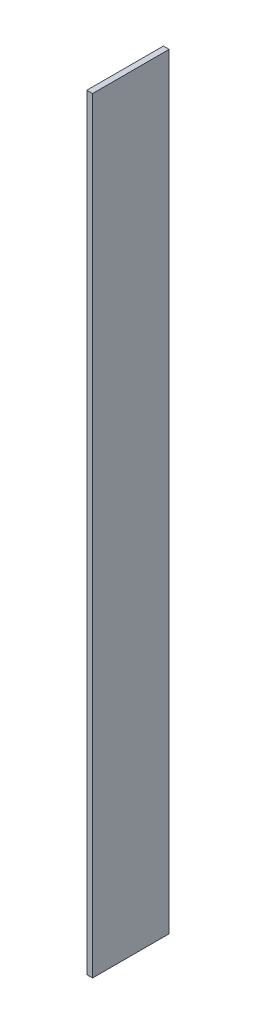
ISO-10303-21;
HEADER;
FILE_DESCRIPTION(('STEP AP214'),'2;1');
FILE_NAME('part.step','',(''),(''),'','','');
FILE_SCHEMA(('AUTOMOTIVE_DESIGN { 1 0 10303 214 1 1 1 1 }'));
ENDSEC;
DATA;
#1=APPLICATION_CONTEXT('core data for automotive mechanical design processes');
#2=APPLICATION_PROTOCOL_DEFINITION('international standard','automotive_design',2000,#1);
#3=PRODUCT_CONTEXT('',#1,'mechanical');
#4=PRODUCT('Part','Part','',(#3));
#5=PRODUCT_RELATED_PRODUCT_CATEGORY('part','',(#4));
#6=PRODUCT_DEFINITION_FORMATION('','',#4);
#7=PRODUCT_DEFINITION_CONTEXT('part definition',#1,'design');
#8=PRODUCT_DEFINITION('design','',#6,#7);
#9=PRODUCT_DEFINITION_SHAPE('','',#8);
#10=(LENGTH_UNIT() NAMED_UNIT(*) SI_UNIT(.MILLI.,.METRE.));
#11=(NAMED_UNIT(*) PLANE_ANGLE_UNIT() SI_UNIT($,.RADIAN.));
#12=(NAMED_UNIT(*) SI_UNIT($,.STERADIAN.) SOLID_ANGLE_UNIT());
#13=UNCERTAINTY_MEASURE_WITH_UNIT(LENGTH_MEASURE(1.E-05),#10,'distance_accuracy_value','');
#14=(GEOMETRIC_REPRESENTATION_CONTEXT(3) GLOBAL_UNCERTAINTY_ASSIGNED_CONTEXT((#13)) GLOBAL_UNIT_ASSIGNED_CONTEXT((#10,
#11,#12)) REPRESENTATION_CONTEXT('',''));
#15=CARTESIAN_POINT('',(0.,0.,0.));
#16=DIRECTION('',(0.,0.,1.));
#17=DIRECTION('',(1.,0.,0.));
#18=AXIS2_PLACEMENT_3D('',#15,#16,#17);
#19=CARTESIAN_POINT('',(1.5,0.,20.));
#20=DIRECTION('',(-1.,0.,0.));
#21=DIRECTION('',(0.,0.,1.));
#22=AXIS2_PLACEMENT_3D('',#19,#20,#21);
#23=PLANE('',#22);
#24=DIRECTION('',(0.,1.,0.));
#25=VECTOR('',#24,1.);
#26=CARTESIAN_POINT('',(1.5,0.,0.));
#27=LINE('',#26,#25);
#28=CARTESIAN_POINT('',(1.5,0.,0.));
#29=VERTEX_POINT('',#28);
#30=CARTESIAN_POINT('',(1.5,200.,0.));
#31=VERTEX_POINT('',#30);
#32=EDGE_CURVE('E100',#29,#31,#27,.T.);
#33=ORIENTED_EDGE('',*,*,#32,.T.);
#34=DIRECTION('',(0.,0.,-1.));
#35=VECTOR('',#34,1.);
#36=CARTESIAN_POINT('',(1.5,200.,20.));
#37=LINE('',#36,#35);
#38=CARTESIAN_POINT('',(1.5,200.,20.));
#39=VERTEX_POINT('',#38);
#40=EDGE_CURVE('E11',#39,#31,#37,.T.);
#41=ORIENTED_EDGE('',*,*,#40,.F.);
#42=DIRECTION('',(0.,1.,0.));
#43=VECTOR('',#42,1.);
#44=CARTESIAN_POINT('',(1.5,0.,20.));
#45=LINE('',#44,#43);
#46=CARTESIAN_POINT('',(1.5,0.,20.));
#47=VERTEX_POINT('',#46);
#48=EDGE_CURVE('E77',#47,#39,#45,.T.);
#49=ORIENTED_EDGE('',*,*,#48,.F.);
#50=DIRECTION('',(0.,0.,-1.));
#51=VECTOR('',#50,1.);
#52=CARTESIAN_POINT('',(1.5,0.,20.));
#53=LINE('',#52,#51);
#54=EDGE_CURVE('E53',#47,#29,#53,.T.);
#55=ORIENTED_EDGE('',*,*,#54,.T.);
#56=EDGE_LOOP('',(#33,#41,#49,#55));
#57=FACE_BOUND('',#56,.T.);
#58=ADVANCED_FACE('F37',(#57),#23,.F.);
#59=CARTESIAN_POINT('',(0.,200.,20.));
#60=DIRECTION('',(0.,1.,0.));
#61=DIRECTION('',(0.,0.,1.));
#62=AXIS2_PLACEMENT_3D('',#59,#60,#61);
#63=PLANE('',#62);
#64=DIRECTION('',(1.,0.,0.));
#65=VECTOR('',#64,1.);
#66=CARTESIAN_POINT('',(0.,200.,0.));
#67=LINE('',#66,#65);
#68=CARTESIAN_POINT('',(0.,200.,0.));
#69=VERTEX_POINT('',#68);
#70=EDGE_CURVE('E86',#69,#31,#67,.T.);
#71=ORIENTED_EDGE('',*,*,#70,.F.);
#72=DIRECTION('',(0.,0.,-1.));
#73=VECTOR('',#72,1.);
#74=CARTESIAN_POINT('',(0.,200.,20.));
#75=LINE('',#74,#73);
#76=CARTESIAN_POINT('',(0.,200.,20.));
#77=VERTEX_POINT('',#76);
#78=EDGE_CURVE('E45',#77,#69,#75,.T.);
#79=ORIENTED_EDGE('',*,*,#78,.F.);
#80=DIRECTION('',(1.,0.,0.));
#81=VECTOR('',#80,1.);
#82=CARTESIAN_POINT('',(0.,200.,20.));
#83=LINE('',#82,#81);
#84=EDGE_CURVE('E84',#77,#39,#83,.T.);
#85=ORIENTED_EDGE('',*,*,#84,.T.);
#86=ORIENTED_EDGE('',*,*,#40,.T.);
#87=EDGE_LOOP('',(#71,#79,#85,#86));
#88=FACE_BOUND('',#87,.T.);
#89=ADVANCED_FACE('F83',(#88),#63,.T.);
#90=CARTESIAN_POINT('',(0.,0.,20.));
#91=DIRECTION('',(-1.,0.,0.));
#92=DIRECTION('',(0.,0.,1.));
#93=AXIS2_PLACEMENT_3D('',#90,#91,#92);
#94=PLANE('',#93);
#95=DIRECTION('',(0.,1.,0.));
#96=VECTOR('',#95,1.);
#97=CARTESIAN_POINT('',(0.,0.,0.));
#98=LINE('',#97,#96);
#99=CARTESIAN_POINT('',(0.,0.,0.));
#100=VERTEX_POINT('',#99);
#101=EDGE_CURVE('E103',#100,#69,#98,.T.);
#102=ORIENTED_EDGE('',*,*,#101,.F.);
#103=DIRECTION('',(0.,0.,-1.));
#104=VECTOR('',#103,1.);
#105=CARTESIAN_POINT('',(0.,0.,20.));
#106=LINE('',#105,#104);
#107=CARTESIAN_POINT('',(0.,0.,20.));
#108=VERTEX_POINT('',#107);
#109=EDGE_CURVE('E66',#108,#100,#106,.T.);
#110=ORIENTED_EDGE('',*,*,#109,.F.);
#111=DIRECTION('',(0.,1.,0.));
#112=VECTOR('',#111,1.);
#113=CARTESIAN_POINT('',(0.,0.,20.));
#114=LINE('',#113,#112);
#115=EDGE_CURVE('E92',#108,#77,#114,.T.);
#116=ORIENTED_EDGE('',*,*,#115,.T.);
#117=ORIENTED_EDGE('',*,*,#78,.T.);
#118=EDGE_LOOP('',(#102,#110,#116,#117));
#119=FACE_BOUND('',#118,.T.);
#120=ADVANCED_FACE('F94',(#119),#94,.T.);
#121=CARTESIAN_POINT('',(1.5,0.,20.));
#122=DIRECTION('',(0.,-1.,0.));
#123=DIRECTION('',(0.,0.,-1.));
#124=AXIS2_PLACEMENT_3D('',#121,#122,#123);
#125=PLANE('',#124);
#126=DIRECTION('',(-1.,0.,0.));
#127=VECTOR('',#126,1.);
#128=CARTESIAN_POINT('',(1.5,0.,0.));
#129=LINE('',#128,#127);
#130=EDGE_CURVE('E105',#29,#100,#129,.T.);
#131=ORIENTED_EDGE('',*,*,#130,.F.);
#132=ORIENTED_EDGE('',*,*,#54,.F.);
#133=DIRECTION('',(-1.,0.,0.));
#134=VECTOR('',#133,1.);
#135=CARTESIAN_POINT('',(1.5,0.,20.));
#136=LINE('',#135,#134);
#137=EDGE_CURVE('E95',#47,#108,#136,.T.);
#138=ORIENTED_EDGE('',*,*,#137,.T.);
#139=ORIENTED_EDGE('',*,*,#109,.T.);
#140=EDGE_LOOP('',(#131,#132,#138,#139));
#141=FACE_BOUND('',#140,.T.);
#142=ADVANCED_FACE('F111',(#141),#125,.T.);
#143=CARTESIAN_POINT('',(0.,0.,20.));
#144=DIRECTION('',(0.,0.,-1.));
#145=DIRECTION('',(-1.,0.,0.));
#146=AXIS2_PLACEMENT_3D('',#143,#144,#145);
#147=PLANE('',#146);
#148=ORIENTED_EDGE('',*,*,#48,.T.);
#149=ORIENTED_EDGE('',*,*,#84,.F.);
#150=ORIENTED_EDGE('',*,*,#115,.F.);
#151=ORIENTED_EDGE('',*,*,#137,.F.);
#152=EDGE_LOOP('',(#148,#149,#150,#151));
#153=FACE_BOUND('',#152,.T.);
#154=ADVANCED_FACE('F91',(#153),#147,.F.);
#155=CARTESIAN_POINT('',(0.,0.,0.));
#156=DIRECTION('',(0.,0.,-1.));
#157=DIRECTION('',(-1.,0.,0.));
#158=AXIS2_PLACEMENT_3D('',#155,#156,#157);
#159=PLANE('',#158);
#160=ORIENTED_EDGE('',*,*,#32,.F.);
#161=ORIENTED_EDGE('',*,*,#130,.T.);
#162=ORIENTED_EDGE('',*,*,#101,.T.);
#163=ORIENTED_EDGE('',*,*,#70,.T.);
#164=EDGE_LOOP('',(#160,#161,#162,#163));
#165=FACE_BOUND('',#164,.T.);
#166=ADVANCED_FACE('F110',(#165),#159,.T.);
#167=CLOSED_SHELL('',(#58,#89,#120,#142,#154,#166));
#168=MANIFOLD_SOLID_BREP('B2',#167);
#169=ADVANCED_BREP_SHAPE_REPRESENTATION('',(#18,#168),#14);
#170=SHAPE_DEFINITION_REPRESENTATION(#9,#169);
ENDSEC;
END-ISO-10303-21;
